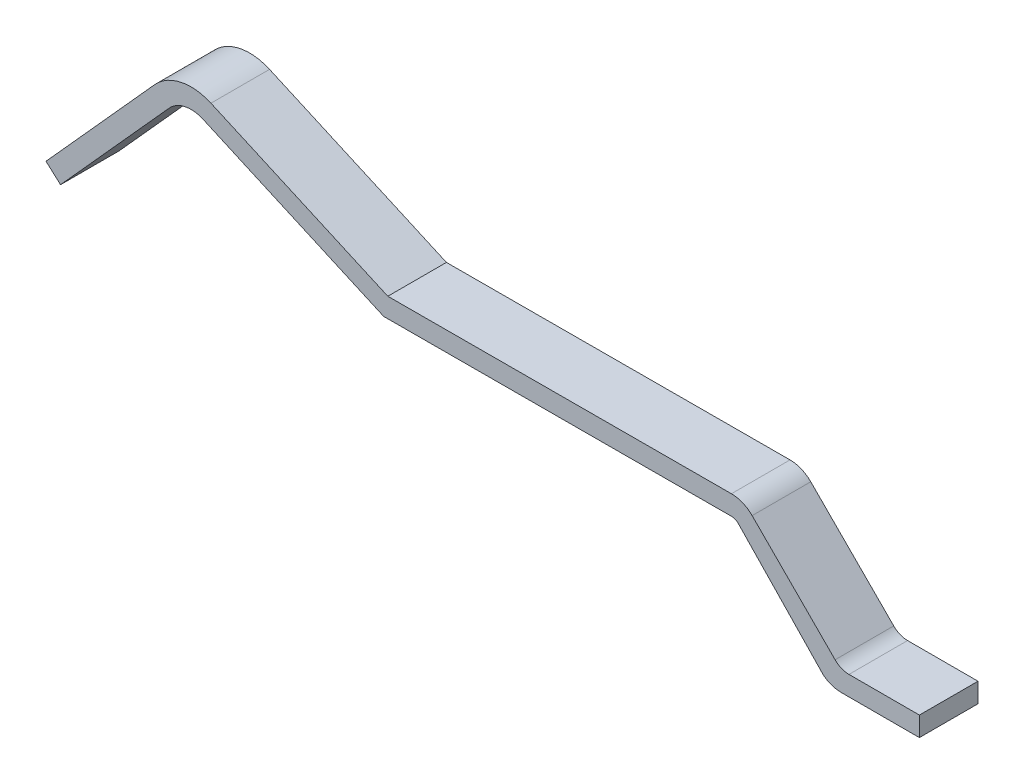
ISO-10303-21;
HEADER;
FILE_DESCRIPTION(('STEP AP214'),'2;1');
FILE_NAME('part.step','',(''),(''),'','','');
FILE_SCHEMA(('AUTOMOTIVE_DESIGN { 1 0 10303 214 1 1 1 1 }'));
ENDSEC;
DATA;
#1=APPLICATION_CONTEXT('core data for automotive mechanical design processes');
#2=APPLICATION_PROTOCOL_DEFINITION('international standard','automotive_design',2000,#1);
#3=PRODUCT_CONTEXT('',#1,'mechanical');
#4=PRODUCT('Part','Part','',(#3));
#5=PRODUCT_RELATED_PRODUCT_CATEGORY('part','',(#4));
#6=PRODUCT_DEFINITION_FORMATION('','',#4);
#7=PRODUCT_DEFINITION_CONTEXT('part definition',#1,'design');
#8=PRODUCT_DEFINITION('design','',#6,#7);
#9=PRODUCT_DEFINITION_SHAPE('','',#8);
#10=(LENGTH_UNIT() NAMED_UNIT(*) SI_UNIT(.MILLI.,.METRE.));
#11=(NAMED_UNIT(*) PLANE_ANGLE_UNIT() SI_UNIT($,.RADIAN.));
#12=(NAMED_UNIT(*) SI_UNIT($,.STERADIAN.) SOLID_ANGLE_UNIT());
#13=UNCERTAINTY_MEASURE_WITH_UNIT(LENGTH_MEASURE(1.E-05),#10,'distance_accuracy_value','');
#14=(GEOMETRIC_REPRESENTATION_CONTEXT(3) GLOBAL_UNCERTAINTY_ASSIGNED_CONTEXT((#13)) GLOBAL_UNIT_ASSIGNED_CONTEXT((#10,
#11,#12)) REPRESENTATION_CONTEXT('',''));
#15=CARTESIAN_POINT('',(0.,0.,0.));
#16=DIRECTION('',(0.,0.,1.));
#17=DIRECTION('',(1.,0.,0.));
#18=AXIS2_PLACEMENT_3D('',#15,#16,#17);
#19=CARTESIAN_POINT('',(17.1707476581065,0.197947805161229,0.3));
#20=DIRECTION('',(0.,-1.,0.));
#21=DIRECTION('',(1.,0.,0.));
#22=AXIS2_PLACEMENT_3D('',#19,#20,#21);
#23=PLANE('',#22);
#24=DIRECTION('',(-1.,0.,0.));
#25=VECTOR('',#24,1.);
#26=CARTESIAN_POINT('',(17.1707476581065,0.197947805161229,-0.3));
#27=LINE('',#26,#25);
#28=CARTESIAN_POINT('',(17.8917527563786,0.197947805161229,-0.3));
#29=VERTEX_POINT('',#28);
#30=CARTESIAN_POINT('',(17.1707476581065,0.197947805161225,-0.3));
#31=VERTEX_POINT('',#30);
#32=EDGE_CURVE('E190',#29,#31,#27,.T.);
#33=ORIENTED_EDGE('',*,*,#32,.T.);
#34=DIRECTION('',(0.,0.,-1.));
#35=VECTOR('',#34,1.);
#36=CARTESIAN_POINT('',(17.1707476581065,0.197947805161225,0.3));
#37=LINE('',#36,#35);
#38=CARTESIAN_POINT('',(17.1707476581065,0.197947805161225,0.3));
#39=VERTEX_POINT('',#38);
#40=EDGE_CURVE('E11',#39,#31,#37,.T.);
#41=ORIENTED_EDGE('',*,*,#40,.F.);
#42=DIRECTION('',(-1.,0.,0.));
#43=VECTOR('',#42,1.);
#44=CARTESIAN_POINT('',(17.1707476581065,0.197947805161229,0.3));
#45=LINE('',#44,#43);
#46=CARTESIAN_POINT('',(17.8917527563786,0.197947805161229,0.3));
#47=VERTEX_POINT('',#46);
#48=EDGE_CURVE('E224',#47,#39,#45,.T.);
#49=ORIENTED_EDGE('',*,*,#48,.F.);
#50=DIRECTION('',(0.,0.,-1.));
#51=VECTOR('',#50,1.);
#52=CARTESIAN_POINT('',(17.8917527563786,0.197947805161229,0.3));
#53=LINE('',#52,#51);
#54=EDGE_CURVE('E186',#47,#29,#53,.T.);
#55=ORIENTED_EDGE('',*,*,#54,.T.);
#56=EDGE_LOOP('',(#33,#41,#49,#55));
#57=FACE_BOUND('',#56,.T.);
#58=ADVANCED_FACE('F34',(#57),#23,.F.);
#59=CARTESIAN_POINT('',(17.1707476581065,0.397947805161221,0.3));
#60=DIRECTION('',(0.,0.,-1.));
#61=DIRECTION('',(-1.,0.,0.));
#62=AXIS2_PLACEMENT_3D('',#59,#60,#61);
#63=CYLINDRICAL_SURFACE('',#62,0.199999999999996);
#64=CARTESIAN_POINT('',(17.1707476581065,0.397947805161221,-0.3));
#65=DIRECTION('',(0.,0.,-1.));
#66=DIRECTION('',(1.,0.,0.));
#67=AXIS2_PLACEMENT_3D('',#64,#65,#66);
#68=CIRCLE('',#67,0.199999999999996);
#69=CARTESIAN_POINT('',(17.0290071205478,0.256846352253875,-0.3));
#70=VERTEX_POINT('',#69);
#71=EDGE_CURVE('E193',#31,#70,#68,.T.);
#72=ORIENTED_EDGE('',*,*,#71,.T.);
#73=DIRECTION('',(0.,0.,-1.));
#74=VECTOR('',#73,1.);
#75=CARTESIAN_POINT('',(17.0290071205478,0.256846352253875,0.3));
#76=LINE('',#75,#74);
#77=CARTESIAN_POINT('',(17.0290071205478,0.256846352253875,0.3));
#78=VERTEX_POINT('',#77);
#79=EDGE_CURVE('E42',#78,#70,#76,.T.);
#80=ORIENTED_EDGE('',*,*,#79,.F.);
#81=CARTESIAN_POINT('',(17.1707476581065,0.397947805161221,0.3));
#82=DIRECTION('',(0.,0.,-1.));
#83=DIRECTION('',(1.,0.,0.));
#84=AXIS2_PLACEMENT_3D('',#81,#82,#83);
#85=CIRCLE('',#84,0.199999999999996);
#86=EDGE_CURVE('E123',#39,#78,#85,.T.);
#87=ORIENTED_EDGE('',*,*,#86,.F.);
#88=ORIENTED_EDGE('',*,*,#40,.T.);
#89=EDGE_LOOP('',(#72,#80,#87,#88));
#90=FACE_BOUND('',#89,.T.);
#91=ADVANCED_FACE('F332',(#90),#63,.F.);
#92=CARTESIAN_POINT('',(16.1796207220227,1.11007983951695,0.3));
#93=DIRECTION('',(-0.708702687793621,-0.705507264536728,0.));
#94=DIRECTION('',(0.705507264536728,-0.708702687793621,0.));
#95=AXIS2_PLACEMENT_3D('',#92,#93,#94);
#96=PLANE('',#95);
#97=DIRECTION('',(-0.705507264536728,0.708702687793621,0.));
#98=VECTOR('',#97,1.);
#99=CARTESIAN_POINT('',(16.1796207220227,1.11007983951695,-0.3));
#100=LINE('',#99,#98);
#101=CARTESIAN_POINT('',(16.1796207220227,1.11007983951695,-0.3));
#102=VERTEX_POINT('',#101);
#103=EDGE_CURVE('E195',#70,#102,#100,.T.);
#104=ORIENTED_EDGE('',*,*,#103,.T.);
#105=DIRECTION('',(0.,0.,-1.));
#106=VECTOR('',#105,1.);
#107=CARTESIAN_POINT('',(16.1796207220227,1.11007983951695,0.3));
#108=LINE('',#107,#106);
#109=CARTESIAN_POINT('',(16.1796207220227,1.11007983951695,0.3));
#110=VERTEX_POINT('',#109);
#111=EDGE_CURVE('E261',#110,#102,#108,.T.);
#112=ORIENTED_EDGE('',*,*,#111,.F.);
#113=DIRECTION('',(-0.705507264536728,0.708702687793621,0.));
#114=VECTOR('',#113,1.);
#115=CARTESIAN_POINT('',(16.1796207220227,1.11007983951695,0.3));
#116=LINE('',#115,#114);
#117=EDGE_CURVE('E269',#78,#110,#116,.T.);
#118=ORIENTED_EDGE('',*,*,#117,.F.);
#119=ORIENTED_EDGE('',*,*,#79,.T.);
#120=EDGE_LOOP('',(#104,#112,#118,#119));
#121=FACE_BOUND('',#120,.T.);
#122=ADVANCED_FACE('F267',(#121),#96,.F.);
#123=CARTESIAN_POINT('',(15.968162863443,0.899575409463471,0.3));
#124=DIRECTION('',(0.,0.,-1.));
#125=DIRECTION('',(-1.,0.,0.));
#126=AXIS2_PLACEMENT_3D('',#123,#124,#125);
#127=CYLINDRICAL_SURFACE('',#126,0.29837315735042);
#128=CARTESIAN_POINT('',(15.968162863443,0.899575409463471,-0.3));
#129=DIRECTION('',(0.,0.,1.));
#130=DIRECTION('',(1.,0.,0.));
#131=AXIS2_PLACEMENT_3D('',#128,#129,#130);
#132=CIRCLE('',#131,0.29837315735042);
#133=CARTESIAN_POINT('',(15.9674886876667,1.197947805161,-0.3));
#134=VERTEX_POINT('',#133);
#135=EDGE_CURVE('E197',#102,#134,#132,.T.);
#136=ORIENTED_EDGE('',*,*,#135,.T.);
#137=DIRECTION('',(0.,0.,-1.));
#138=VECTOR('',#137,1.);
#139=CARTESIAN_POINT('',(15.9674886876667,1.197947805161,0.3));
#140=LINE('',#139,#138);
#141=CARTESIAN_POINT('',(15.9674886876667,1.197947805161,0.3));
#142=VERTEX_POINT('',#141);
#143=EDGE_CURVE('E258',#142,#134,#140,.T.);
#144=ORIENTED_EDGE('',*,*,#143,.F.);
#145=CARTESIAN_POINT('',(15.968162863443,0.899575409463471,0.3));
#146=DIRECTION('',(0.,0.,1.));
#147=DIRECTION('',(1.,0.,0.));
#148=AXIS2_PLACEMENT_3D('',#145,#146,#147);
#149=CIRCLE('',#148,0.29837315735042);
#150=EDGE_CURVE('E287',#110,#142,#149,.T.);
#151=ORIENTED_EDGE('',*,*,#150,.F.);
#152=ORIENTED_EDGE('',*,*,#111,.T.);
#153=EDGE_LOOP('',(#136,#144,#151,#152));
#154=FACE_BOUND('',#153,.T.);
#155=ADVANCED_FACE('F278',(#154),#127,.T.);
#156=CARTESIAN_POINT('',(12.45,1.19000000000001,0.3));
#157=DIRECTION('',(0.00225950545359394,-0.999997447314294,0.));
#158=DIRECTION('',(0.999997447314295,0.00225950545359394,0.));
#159=AXIS2_PLACEMENT_3D('',#156,#157,#158);
#160=PLANE('',#159);
#161=DIRECTION('',(-0.999997447314295,-0.00225950545359394,0.));
#162=VECTOR('',#161,1.);
#163=CARTESIAN_POINT('',(12.45,1.19000000000001,-0.3));
#164=LINE('',#163,#162);
#165=CARTESIAN_POINT('',(12.45,1.19000000000001,-0.3));
#166=VERTEX_POINT('',#165);
#167=EDGE_CURVE('E199',#134,#166,#164,.T.);
#168=ORIENTED_EDGE('',*,*,#167,.T.);
#169=DIRECTION('',(0.,0.,-1.));
#170=VECTOR('',#169,1.);
#171=CARTESIAN_POINT('',(12.45,1.19000000000001,0.3));
#172=LINE('',#171,#170);
#173=CARTESIAN_POINT('',(12.45,1.19000000000001,0.3));
#174=VERTEX_POINT('',#173);
#175=EDGE_CURVE('E255',#174,#166,#172,.T.);
#176=ORIENTED_EDGE('',*,*,#175,.F.);
#177=DIRECTION('',(-0.999997447314295,-0.00225950545359394,0.));
#178=VECTOR('',#177,1.);
#179=CARTESIAN_POINT('',(12.45,1.19000000000001,0.3));
#180=LINE('',#179,#178);
#181=EDGE_CURVE('E284',#142,#174,#180,.T.);
#182=ORIENTED_EDGE('',*,*,#181,.F.);
#183=ORIENTED_EDGE('',*,*,#143,.T.);
#184=EDGE_LOOP('',(#168,#176,#182,#183));
#185=FACE_BOUND('',#184,.T.);
#186=ADVANCED_FACE('F282',(#185),#160,.F.);
#187=CARTESIAN_POINT('',(10.6393188810586,1.9961671740989,0.3));
#188=DIRECTION('',(-0.40673664307565,-0.913545457642667,0.));
#189=DIRECTION('',(0.913545457642668,-0.40673664307565,0.));
#190=AXIS2_PLACEMENT_3D('',#187,#188,#189);
#191=PLANE('',#190);
#192=DIRECTION('',(-0.913545457642668,0.40673664307565,0.));
#193=VECTOR('',#192,1.);
#194=CARTESIAN_POINT('',(10.6393188810586,1.9961671740989,-0.3));
#195=LINE('',#194,#193);
#196=CARTESIAN_POINT('',(10.6393188810586,1.9961671740989,-0.3));
#197=VERTEX_POINT('',#196);
#198=EDGE_CURVE('E201',#166,#197,#195,.T.);
#199=ORIENTED_EDGE('',*,*,#198,.T.);
#200=DIRECTION('',(0.,0.,-1.));
#201=VECTOR('',#200,1.);
#202=CARTESIAN_POINT('',(10.6393188810586,1.9961671740989,0.3));
#203=LINE('',#202,#201);
#204=CARTESIAN_POINT('',(10.6393188810586,1.9961671740989,0.3));
#205=VERTEX_POINT('',#204);
#206=EDGE_CURVE('E252',#205,#197,#203,.T.);
#207=ORIENTED_EDGE('',*,*,#206,.F.);
#208=DIRECTION('',(-0.913545457642668,0.40673664307565,0.));
#209=VECTOR('',#208,1.);
#210=CARTESIAN_POINT('',(10.6393188810586,1.9961671740989,0.3));
#211=LINE('',#210,#209);
#212=EDGE_CURVE('E286',#174,#205,#211,.T.);
#213=ORIENTED_EDGE('',*,*,#212,.F.);
#214=ORIENTED_EDGE('',*,*,#175,.T.);
#215=EDGE_LOOP('',(#199,#207,#213,#214));
#216=FACE_BOUND('',#215,.T.);
#217=ADVANCED_FACE('F345',(#216),#191,.F.);
#218=CARTESIAN_POINT('',(10.4359505595208,1.53939444527736,0.3));
#219=DIRECTION('',(0.,0.,-1.));
#220=DIRECTION('',(-1.,0.,0.));
#221=AXIS2_PLACEMENT_3D('',#218,#219,#220);
#222=CYLINDRICAL_SURFACE('',#221,0.50000000000019);
#223=CARTESIAN_POINT('',(10.4359505595208,1.53939444527736,-0.3));
#224=DIRECTION('',(0.,0.,1.));
#225=DIRECTION('',(1.,0.,0.));
#226=AXIS2_PLACEMENT_3D('',#223,#224,#225);
#227=CIRCLE('',#226,0.50000000000019);
#228=CARTESIAN_POINT('',(10.0643781467819,1.87395974845692,-0.3));
#229=VERTEX_POINT('',#228);
#230=EDGE_CURVE('E203',#197,#229,#227,.T.);
#231=ORIENTED_EDGE('',*,*,#230,.T.);
#232=DIRECTION('',(0.,0.,-1.));
#233=VECTOR('',#232,1.);
#234=CARTESIAN_POINT('',(10.0643781467819,1.87395974845692,0.3));
#235=LINE('',#234,#233);
#236=CARTESIAN_POINT('',(10.0643781467819,1.87395974845692,0.3));
#237=VERTEX_POINT('',#236);
#238=EDGE_CURVE('E249',#237,#229,#235,.T.);
#239=ORIENTED_EDGE('',*,*,#238,.F.);
#240=CARTESIAN_POINT('',(10.4359505595208,1.53939444527736,0.3));
#241=DIRECTION('',(0.,0.,1.));
#242=DIRECTION('',(1.,0.,0.));
#243=AXIS2_PLACEMENT_3D('',#240,#241,#242);
#244=CIRCLE('',#243,0.50000000000019);
#245=EDGE_CURVE('E289',#205,#237,#244,.T.);
#246=ORIENTED_EDGE('',*,*,#245,.F.);
#247=ORIENTED_EDGE('',*,*,#206,.T.);
#248=EDGE_LOOP('',(#231,#239,#246,#247));
#249=FACE_BOUND('',#248,.T.);
#250=ADVANCED_FACE('F348',(#249),#222,.T.);
#251=CARTESIAN_POINT('',(8.95090286046869,0.63732016052452,0.3));
#252=DIRECTION('',(0.743144825477361,-0.669130606358895,0.));
#253=DIRECTION('',(0.669130606358895,0.743144825477361,0.));
#254=AXIS2_PLACEMENT_3D('',#251,#252,#253);
#255=PLANE('',#254);
#256=DIRECTION('',(-0.669130606358895,-0.743144825477361,0.));
#257=VECTOR('',#256,1.);
#258=CARTESIAN_POINT('',(8.95090286046869,0.63732016052452,-0.3));
#259=LINE('',#258,#257);
#260=CARTESIAN_POINT('',(8.95090286046869,0.63732016052452,-0.3));
#261=VERTEX_POINT('',#260);
#262=EDGE_CURVE('E205',#229,#261,#259,.T.);
#263=ORIENTED_EDGE('',*,*,#262,.T.);
#264=DIRECTION('',(0.,0.,-1.));
#265=VECTOR('',#264,1.);
#266=CARTESIAN_POINT('',(8.95090286046869,0.63732016052452,0.3));
#267=LINE('',#266,#265);
#268=CARTESIAN_POINT('',(8.95090286046869,0.63732016052452,0.3));
#269=VERTEX_POINT('',#268);
#270=EDGE_CURVE('E246',#269,#261,#267,.T.);
#271=ORIENTED_EDGE('',*,*,#270,.F.);
#272=DIRECTION('',(-0.669130606358895,-0.743144825477361,0.));
#273=VECTOR('',#272,1.);
#274=CARTESIAN_POINT('',(8.95090286046869,0.63732016052452,0.3));
#275=LINE('',#274,#273);
#276=EDGE_CURVE('E295',#237,#269,#275,.T.);
#277=ORIENTED_EDGE('',*,*,#276,.F.);
#278=ORIENTED_EDGE('',*,*,#238,.T.);
#279=EDGE_LOOP('',(#263,#271,#277,#278));
#280=FACE_BOUND('',#279,.T.);
#281=ADVANCED_FACE('F352',(#280),#255,.F.);
#282=CARTESIAN_POINT('',(9.09953182556442,0.503494039252559,0.3));
#283=DIRECTION('',(0.669130606358746,0.743144825477495,0.));
#284=DIRECTION('',(-0.743144825477495,0.669130606358746,0.));
#285=AXIS2_PLACEMENT_3D('',#282,#283,#284);
#286=PLANE('',#285);
#287=DIRECTION('',(0.743144825477495,-0.669130606358746,0.));
#288=VECTOR('',#287,1.);
#289=CARTESIAN_POINT('',(9.09953182556442,0.503494039252559,-0.3));
#290=LINE('',#289,#288);
#291=CARTESIAN_POINT('',(9.09953182556442,0.503494039252559,-0.3));
#292=VERTEX_POINT('',#291);
#293=EDGE_CURVE('E207',#261,#292,#290,.T.);
#294=ORIENTED_EDGE('',*,*,#293,.T.);
#295=DIRECTION('',(0.,0.,-1.));
#296=VECTOR('',#295,1.);
#297=CARTESIAN_POINT('',(9.09953182556442,0.503494039252559,0.3));
#298=LINE('',#297,#296);
#299=CARTESIAN_POINT('',(9.09953182556442,0.503494039252559,0.3));
#300=VERTEX_POINT('',#299);
#301=EDGE_CURVE('E243',#300,#292,#298,.T.);
#302=ORIENTED_EDGE('',*,*,#301,.F.);
#303=DIRECTION('',(0.743144825477495,-0.669130606358746,0.));
#304=VECTOR('',#303,1.);
#305=CARTESIAN_POINT('',(9.09953182556442,0.503494039252559,0.3));
#306=LINE('',#305,#304);
#307=EDGE_CURVE('E297',#269,#300,#306,.T.);
#308=ORIENTED_EDGE('',*,*,#307,.F.);
#309=ORIENTED_EDGE('',*,*,#270,.T.);
#310=EDGE_LOOP('',(#294,#302,#308,#309));
#311=FACE_BOUND('',#310,.T.);
#312=ADVANCED_FACE('F356',(#311),#286,.F.);
#313=CARTESIAN_POINT('',(10.2130071118774,1.74013362718514,0.3));
#314=DIRECTION('',(-0.743144825477495,0.669130606358746,0.));
#315=DIRECTION('',(-0.669130606358746,-0.743144825477495,0.));
#316=AXIS2_PLACEMENT_3D('',#313,#314,#315);
#317=PLANE('',#316);
#318=DIRECTION('',(0.669130606358746,0.743144825477495,0.));
#319=VECTOR('',#318,1.);
#320=CARTESIAN_POINT('',(10.2130071118774,1.74013362718514,-0.3));
#321=LINE('',#320,#319);
#322=CARTESIAN_POINT('',(10.2130071118774,1.74013362718514,-0.3));
#323=VERTEX_POINT('',#322);
#324=EDGE_CURVE('E209',#292,#323,#321,.T.);
#325=ORIENTED_EDGE('',*,*,#324,.T.);
#326=DIRECTION('',(0.,0.,-1.));
#327=VECTOR('',#326,1.);
#328=CARTESIAN_POINT('',(10.2130071118774,1.74013362718514,0.3));
#329=LINE('',#328,#327);
#330=CARTESIAN_POINT('',(10.2130071118774,1.74013362718514,0.3));
#331=VERTEX_POINT('',#330);
#332=EDGE_CURVE('E240',#331,#323,#329,.T.);
#333=ORIENTED_EDGE('',*,*,#332,.F.);
#334=DIRECTION('',(0.669130606358746,0.743144825477495,0.));
#335=VECTOR('',#334,1.);
#336=CARTESIAN_POINT('',(10.2130071118774,1.74013362718514,0.3));
#337=LINE('',#336,#335);
#338=EDGE_CURVE('E299',#300,#331,#337,.T.);
#339=ORIENTED_EDGE('',*,*,#338,.F.);
#340=ORIENTED_EDGE('',*,*,#301,.T.);
#341=EDGE_LOOP('',(#325,#333,#339,#340));
#342=FACE_BOUND('',#341,.T.);
#343=ADVANCED_FACE('F360',(#342),#317,.F.);
#344=CARTESIAN_POINT('',(10.4359505595208,1.53939444527741,0.3));
#345=DIRECTION('',(0.,0.,-1.));
#346=DIRECTION('',(-1.,0.,0.));
#347=AXIS2_PLACEMENT_3D('',#344,#345,#346);
#348=CYLINDRICAL_SURFACE('',#347,0.300000000000162);
#349=CARTESIAN_POINT('',(10.4359505595208,1.53939444527741,-0.3));
#350=DIRECTION('',(0.,0.,-1.));
#351=DIRECTION('',(1.,0.,0.));
#352=AXIS2_PLACEMENT_3D('',#349,#350,#351);
#353=CIRCLE('',#352,0.300000000000162);
#354=CARTESIAN_POINT('',(10.5579715524435,1.81345808257036,-0.3));
#355=VERTEX_POINT('',#354);
#356=EDGE_CURVE('E211',#323,#355,#353,.T.);
#357=ORIENTED_EDGE('',*,*,#356,.T.);
#358=DIRECTION('',(0.,0.,-1.));
#359=VECTOR('',#358,1.);
#360=CARTESIAN_POINT('',(10.5579715524435,1.81345808257036,0.3));
#361=LINE('',#360,#359);
#362=CARTESIAN_POINT('',(10.5579715524435,1.81345808257036,0.3));
#363=VERTEX_POINT('',#362);
#364=EDGE_CURVE('E237',#363,#355,#361,.T.);
#365=ORIENTED_EDGE('',*,*,#364,.F.);
#366=CARTESIAN_POINT('',(10.4359505595208,1.53939444527741,0.3));
#367=DIRECTION('',(0.,0.,-1.));
#368=DIRECTION('',(1.,0.,0.));
#369=AXIS2_PLACEMENT_3D('',#366,#367,#368);
#370=CIRCLE('',#369,0.300000000000162);
#371=EDGE_CURVE('E301',#331,#363,#370,.T.);
#372=ORIENTED_EDGE('',*,*,#371,.F.);
#373=ORIENTED_EDGE('',*,*,#332,.T.);
#374=EDGE_LOOP('',(#357,#365,#372,#373));
#375=FACE_BOUND('',#374,.T.);
#376=ADVANCED_FACE('F364',(#375),#348,.F.);
#377=CARTESIAN_POINT('',(12.407488687666,0.99,0.3));
#378=DIRECTION('',(0.40673664307565,0.913545457642667,0.));
#379=DIRECTION('',(-0.913545457642668,0.40673664307565,0.));
#380=AXIS2_PLACEMENT_3D('',#377,#378,#379);
#381=PLANE('',#380);
#382=DIRECTION('',(0.913545457642668,-0.40673664307565,0.));
#383=VECTOR('',#382,1.);
#384=CARTESIAN_POINT('',(12.407488687666,0.99,-0.3));
#385=LINE('',#384,#383);
#386=CARTESIAN_POINT('',(12.407488687666,0.99,-0.3));
#387=VERTEX_POINT('',#386);
#388=EDGE_CURVE('E213',#355,#387,#385,.T.);
#389=ORIENTED_EDGE('',*,*,#388,.T.);
#390=DIRECTION('',(0.,0.,-1.));
#391=VECTOR('',#390,1.);
#392=CARTESIAN_POINT('',(12.407488687666,0.99,0.3));
#393=LINE('',#392,#391);
#394=CARTESIAN_POINT('',(12.407488687666,0.99,0.3));
#395=VERTEX_POINT('',#394);
#396=EDGE_CURVE('E234',#395,#387,#393,.T.);
#397=ORIENTED_EDGE('',*,*,#396,.F.);
#398=DIRECTION('',(0.913545457642668,-0.40673664307565,0.));
#399=VECTOR('',#398,1.);
#400=CARTESIAN_POINT('',(12.407488687666,0.99,0.3));
#401=LINE('',#400,#399);
#402=EDGE_CURVE('E303',#363,#395,#401,.T.);
#403=ORIENTED_EDGE('',*,*,#402,.F.);
#404=ORIENTED_EDGE('',*,*,#364,.T.);
#405=EDGE_LOOP('',(#389,#397,#403,#404));
#406=FACE_BOUND('',#405,.T.);
#407=ADVANCED_FACE('F368',(#406),#381,.F.);
#408=CARTESIAN_POINT('',(15.967488687666,0.998043859948213,0.3));
#409=DIRECTION('',(-0.00225950545358628,0.999997447314294,0.));
#410=DIRECTION('',(-0.999997447314295,-0.00225950545358628,0.));
#411=AXIS2_PLACEMENT_3D('',#408,#409,#410);
#412=PLANE('',#411);
#413=DIRECTION('',(0.999997447314295,0.00225950545358628,0.));
#414=VECTOR('',#413,1.);
#415=CARTESIAN_POINT('',(15.967488687666,0.998043859948213,-0.3));
#416=LINE('',#415,#414);
#417=CARTESIAN_POINT('',(15.967488687666,0.998043859948221,-0.3));
#418=VERTEX_POINT('',#417);
#419=EDGE_CURVE('E215',#387,#418,#416,.T.);
#420=ORIENTED_EDGE('',*,*,#419,.T.);
#421=DIRECTION('',(0.,0.,-1.));
#422=VECTOR('',#421,1.);
#423=CARTESIAN_POINT('',(15.967488687666,0.998043859948221,0.3));
#424=LINE('',#423,#422);
#425=CARTESIAN_POINT('',(15.967488687666,0.998043859948221,0.3));
#426=VERTEX_POINT('',#425);
#427=EDGE_CURVE('E231',#426,#418,#424,.T.);
#428=ORIENTED_EDGE('',*,*,#427,.F.);
#429=DIRECTION('',(0.999997447314295,0.00225950545358628,0.));
#430=VECTOR('',#429,1.);
#431=CARTESIAN_POINT('',(15.967488687666,0.998043859948213,0.3));
#432=LINE('',#431,#430);
#433=EDGE_CURVE('E305',#395,#426,#432,.T.);
#434=ORIENTED_EDGE('',*,*,#433,.F.);
#435=ORIENTED_EDGE('',*,*,#396,.T.);
#436=EDGE_LOOP('',(#420,#428,#434,#435));
#437=FACE_BOUND('',#436,.T.);
#438=ADVANCED_FACE('F372',(#437),#412,.F.);
#439=CARTESIAN_POINT('',(15.9677134245142,0.898581265536285,0.3));
#440=DIRECTION('',(0.,0.,-1.));
#441=DIRECTION('',(-1.,0.,0.));
#442=AXIS2_PLACEMENT_3D('',#439,#440,#441);
#443=CYLINDRICAL_SURFACE('',#442,0.0994628483093272);
#444=CARTESIAN_POINT('',(15.9677134245142,0.898581265536285,-0.3));
#445=DIRECTION('',(0.,0.,-1.));
#446=DIRECTION('',(-1.,0.,0.));
#447=AXIS2_PLACEMENT_3D('',#444,#445,#446);
#448=CIRCLE('',#447,0.0994628483093272);
#449=CARTESIAN_POINT('',(16.0381993657854,0.968756690557605,-0.3));
#450=VERTEX_POINT('',#449);
#451=EDGE_CURVE('E217',#418,#450,#448,.T.);
#452=ORIENTED_EDGE('',*,*,#451,.T.);
#453=DIRECTION('',(0.,0.,-1.));
#454=VECTOR('',#453,1.);
#455=CARTESIAN_POINT('',(16.0381993657854,0.968756690557605,0.3));
#456=LINE('',#455,#454);
#457=CARTESIAN_POINT('',(16.0381993657854,0.968756690557605,0.3));
#458=VERTEX_POINT('',#457);
#459=EDGE_CURVE('E228',#458,#450,#456,.T.);
#460=ORIENTED_EDGE('',*,*,#459,.F.);
#461=CARTESIAN_POINT('',(15.9677134245142,0.898581265536285,0.3));
#462=DIRECTION('',(0.,0.,-1.));
#463=DIRECTION('',(-1.,0.,0.));
#464=AXIS2_PLACEMENT_3D('',#461,#462,#463);
#465=CIRCLE('',#464,0.0994628483093272);
#466=EDGE_CURVE('E307',#426,#458,#465,.T.);
#467=ORIENTED_EDGE('',*,*,#466,.F.);
#468=ORIENTED_EDGE('',*,*,#427,.T.);
#469=EDGE_LOOP('',(#452,#460,#467,#468));
#470=FACE_BOUND('',#469,.T.);
#471=ADVANCED_FACE('F313',(#470),#443,.F.);
#472=CARTESIAN_POINT('',(16.9117527563786,0.0579478051610878,0.3));
#473=DIRECTION('',(0.72171309209664,0.692192323488427,0.));
#474=DIRECTION('',(-0.692192323488427,0.72171309209664,0.));
#475=AXIS2_PLACEMENT_3D('',#472,#473,#474);
#476=PLANE('',#475);
#477=DIRECTION('',(0.692192323488427,-0.72171309209664,0.));
#478=VECTOR('',#477,1.);
#479=CARTESIAN_POINT('',(16.9117527563786,0.0579478051610878,-0.3));
#480=LINE('',#479,#478);
#481=CARTESIAN_POINT('',(16.9117527563786,0.0579478051610877,-0.3));
#482=VERTEX_POINT('',#481);
#483=EDGE_CURVE('E219',#450,#482,#480,.T.);
#484=ORIENTED_EDGE('',*,*,#483,.T.);
#485=DIRECTION('',(0.,0.,-1.));
#486=VECTOR('',#485,1.);
#487=CARTESIAN_POINT('',(16.9117527563786,0.0579478051610877,0.3));
#488=LINE('',#487,#486);
#489=CARTESIAN_POINT('',(16.9117527563786,0.0579478051610877,0.3));
#490=VERTEX_POINT('',#489);
#491=EDGE_CURVE('E181',#490,#482,#488,.T.);
#492=ORIENTED_EDGE('',*,*,#491,.F.);
#493=DIRECTION('',(0.692192323488427,-0.72171309209664,0.));
#494=VECTOR('',#493,1.);
#495=CARTESIAN_POINT('',(16.9117527563786,0.0579478051610878,0.3));
#496=LINE('',#495,#494);
#497=EDGE_CURVE('E172',#458,#490,#496,.T.);
#498=ORIENTED_EDGE('',*,*,#497,.F.);
#499=ORIENTED_EDGE('',*,*,#459,.T.);
#500=EDGE_LOOP('',(#484,#492,#498,#499));
#501=FACE_BOUND('',#500,.T.);
#502=ADVANCED_FACE('F317',(#501),#476,.F.);
#503=CARTESIAN_POINT('',(17.0917527563786,0.297947805161533,0.3));
#504=DIRECTION('',(0.,0.,-1.));
#505=DIRECTION('',(-1.,0.,0.));
#506=AXIS2_PLACEMENT_3D('',#503,#504,#505);
#507=CYLINDRICAL_SURFACE('',#506,0.300000000000358);
#508=CARTESIAN_POINT('',(17.0917527563786,0.297947805161533,-0.3));
#509=DIRECTION('',(0.,0.,1.));
#510=DIRECTION('',(-1.,0.,0.));
#511=AXIS2_PLACEMENT_3D('',#508,#509,#510);
#512=CIRCLE('',#511,0.300000000000358);
#513=CARTESIAN_POINT('',(17.0917527563786,-0.00205219483882501,-0.3));
#514=VERTEX_POINT('',#513);
#515=EDGE_CURVE('E180',#482,#514,#512,.T.);
#516=ORIENTED_EDGE('',*,*,#515,.T.);
#517=DIRECTION('',(0.,0.,-1.));
#518=VECTOR('',#517,1.);
#519=CARTESIAN_POINT('',(17.0917527563786,-0.00205219483882501,0.3));
#520=LINE('',#519,#518);
#521=CARTESIAN_POINT('',(17.0917527563786,-0.00205219483882501,0.3));
#522=VERTEX_POINT('',#521);
#523=EDGE_CURVE('E177',#522,#514,#520,.T.);
#524=ORIENTED_EDGE('',*,*,#523,.F.);
#525=CARTESIAN_POINT('',(17.0917527563786,0.297947805161533,0.3));
#526=DIRECTION('',(0.,0.,1.));
#527=DIRECTION('',(-1.,0.,0.));
#528=AXIS2_PLACEMENT_3D('',#525,#526,#527);
#529=CIRCLE('',#528,0.300000000000358);
#530=EDGE_CURVE('E166',#490,#522,#529,.T.);
#531=ORIENTED_EDGE('',*,*,#530,.F.);
#532=ORIENTED_EDGE('',*,*,#491,.T.);
#533=EDGE_LOOP('',(#516,#524,#531,#532));
#534=FACE_BOUND('',#533,.T.);
#535=ADVANCED_FACE('F178',(#534),#507,.T.);
#536=CARTESIAN_POINT('',(17.8917527563786,-0.00205219483882491,0.3));
#537=DIRECTION('',(0.,1.,0.));
#538=DIRECTION('',(-1.,0.,0.));
#539=AXIS2_PLACEMENT_3D('',#536,#537,#538);
#540=PLANE('',#539);
#541=DIRECTION('',(1.,0.,0.));
#542=VECTOR('',#541,1.);
#543=CARTESIAN_POINT('',(17.8917527563786,-0.00205219483882491,-0.3));
#544=LINE('',#543,#542);
#545=CARTESIAN_POINT('',(17.8917527563786,-0.00205219483882491,-0.3));
#546=VERTEX_POINT('',#545);
#547=EDGE_CURVE('E109',#514,#546,#544,.T.);
#548=ORIENTED_EDGE('',*,*,#547,.T.);
#549=DIRECTION('',(0.,0.,-1.));
#550=VECTOR('',#549,1.);
#551=CARTESIAN_POINT('',(17.8917527563786,-0.00205219483882491,0.3));
#552=LINE('',#551,#550);
#553=CARTESIAN_POINT('',(17.8917527563786,-0.00205219483882491,0.3));
#554=VERTEX_POINT('',#553);
#555=EDGE_CURVE('E182',#554,#546,#552,.T.);
#556=ORIENTED_EDGE('',*,*,#555,.F.);
#557=DIRECTION('',(1.,0.,0.));
#558=VECTOR('',#557,1.);
#559=CARTESIAN_POINT('',(17.8917527563786,-0.00205219483882491,0.3));
#560=LINE('',#559,#558);
#561=EDGE_CURVE('E170',#522,#554,#560,.T.);
#562=ORIENTED_EDGE('',*,*,#561,.F.);
#563=ORIENTED_EDGE('',*,*,#523,.T.);
#564=EDGE_LOOP('',(#548,#556,#562,#563));
#565=FACE_BOUND('',#564,.T.);
#566=ADVANCED_FACE('F184',(#565),#540,.F.);
#567=CARTESIAN_POINT('',(17.8917527563786,0.197947805161229,0.3));
#568=DIRECTION('',(-1.,0.,0.));
#569=DIRECTION('',(0.,0.,1.));
#570=AXIS2_PLACEMENT_3D('',#567,#568,#569);
#571=PLANE('',#570);
#572=DIRECTION('',(0.,1.,0.));
#573=VECTOR('',#572,1.);
#574=CARTESIAN_POINT('',(17.8917527563786,0.197947805161229,-0.3));
#575=LINE('',#574,#573);
#576=EDGE_CURVE('E115',#546,#29,#575,.T.);
#577=ORIENTED_EDGE('',*,*,#576,.T.);
#578=ORIENTED_EDGE('',*,*,#54,.F.);
#579=DIRECTION('',(0.,1.,0.));
#580=VECTOR('',#579,1.);
#581=CARTESIAN_POINT('',(17.8917527563786,0.197947805161229,0.3));
#582=LINE('',#581,#580);
#583=EDGE_CURVE('E50',#554,#47,#582,.T.);
#584=ORIENTED_EDGE('',*,*,#583,.F.);
#585=ORIENTED_EDGE('',*,*,#555,.T.);
#586=EDGE_LOOP('',(#577,#578,#584,#585));
#587=FACE_BOUND('',#586,.T.);
#588=ADVANCED_FACE('F321',(#587),#571,.F.);
#589=CARTESIAN_POINT('',(17.0917527563786,0.297947805161533,0.3));
#590=DIRECTION('',(0.,0.,-1.));
#591=DIRECTION('',(-1.,0.,0.));
#592=AXIS2_PLACEMENT_3D('',#589,#590,#591);
#593=PLANE('',#592);
#594=ORIENTED_EDGE('',*,*,#48,.T.);
#595=ORIENTED_EDGE('',*,*,#86,.T.);
#596=ORIENTED_EDGE('',*,*,#117,.T.);
#597=ORIENTED_EDGE('',*,*,#150,.T.);
#598=ORIENTED_EDGE('',*,*,#181,.T.);
#599=ORIENTED_EDGE('',*,*,#212,.T.);
#600=ORIENTED_EDGE('',*,*,#245,.T.);
#601=ORIENTED_EDGE('',*,*,#276,.T.);
#602=ORIENTED_EDGE('',*,*,#307,.T.);
#603=ORIENTED_EDGE('',*,*,#338,.T.);
#604=ORIENTED_EDGE('',*,*,#371,.T.);
#605=ORIENTED_EDGE('',*,*,#402,.T.);
#606=ORIENTED_EDGE('',*,*,#433,.T.);
#607=ORIENTED_EDGE('',*,*,#466,.T.);
#608=ORIENTED_EDGE('',*,*,#497,.T.);
#609=ORIENTED_EDGE('',*,*,#530,.T.);
#610=ORIENTED_EDGE('',*,*,#561,.T.);
#611=ORIENTED_EDGE('',*,*,#583,.T.);
#612=EDGE_LOOP('',(#594,#595,#596,#597,#598,#599,#600,#601,#602,#603,#604,#605,#606,#607,#608,
#609,#610,#611));
#613=FACE_BOUND('',#612,.T.);
#614=ADVANCED_FACE('F168',(#613),#593,.F.);
#615=CARTESIAN_POINT('',(17.0917527563786,0.297947805161533,-0.3));
#616=DIRECTION('',(0.,0.,-1.));
#617=DIRECTION('',(-1.,0.,0.));
#618=AXIS2_PLACEMENT_3D('',#615,#616,#617);
#619=PLANE('',#618);
#620=ORIENTED_EDGE('',*,*,#32,.F.);
#621=ORIENTED_EDGE('',*,*,#576,.F.);
#622=ORIENTED_EDGE('',*,*,#547,.F.);
#623=ORIENTED_EDGE('',*,*,#515,.F.);
#624=ORIENTED_EDGE('',*,*,#483,.F.);
#625=ORIENTED_EDGE('',*,*,#451,.F.);
#626=ORIENTED_EDGE('',*,*,#419,.F.);
#627=ORIENTED_EDGE('',*,*,#388,.F.);
#628=ORIENTED_EDGE('',*,*,#356,.F.);
#629=ORIENTED_EDGE('',*,*,#324,.F.);
#630=ORIENTED_EDGE('',*,*,#293,.F.);
#631=ORIENTED_EDGE('',*,*,#262,.F.);
#632=ORIENTED_EDGE('',*,*,#230,.F.);
#633=ORIENTED_EDGE('',*,*,#198,.F.);
#634=ORIENTED_EDGE('',*,*,#167,.F.);
#635=ORIENTED_EDGE('',*,*,#135,.F.);
#636=ORIENTED_EDGE('',*,*,#103,.F.);
#637=ORIENTED_EDGE('',*,*,#71,.F.);
#638=EDGE_LOOP('',(#620,#621,#622,#623,#624,#625,#626,#627,#628,#629,#630,#631,#632,#633,#634,
#635,#636,#637));
#639=FACE_BOUND('',#638,.T.);
#640=ADVANCED_FACE('F273',(#639),#619,.T.);
#641=CLOSED_SHELL('',(#58,#91,#122,#155,#186,#217,#250,#281,#312,#343,#376,#407,#438,#471,#502,
#535,#566,#588,#614,#640));
#642=MANIFOLD_SOLID_BREP('B2',#641);
#643=ADVANCED_BREP_SHAPE_REPRESENTATION('',(#18,#642),#14);
#644=SHAPE_DEFINITION_REPRESENTATION(#9,#643);
ENDSEC;
END-ISO-10303-21;
